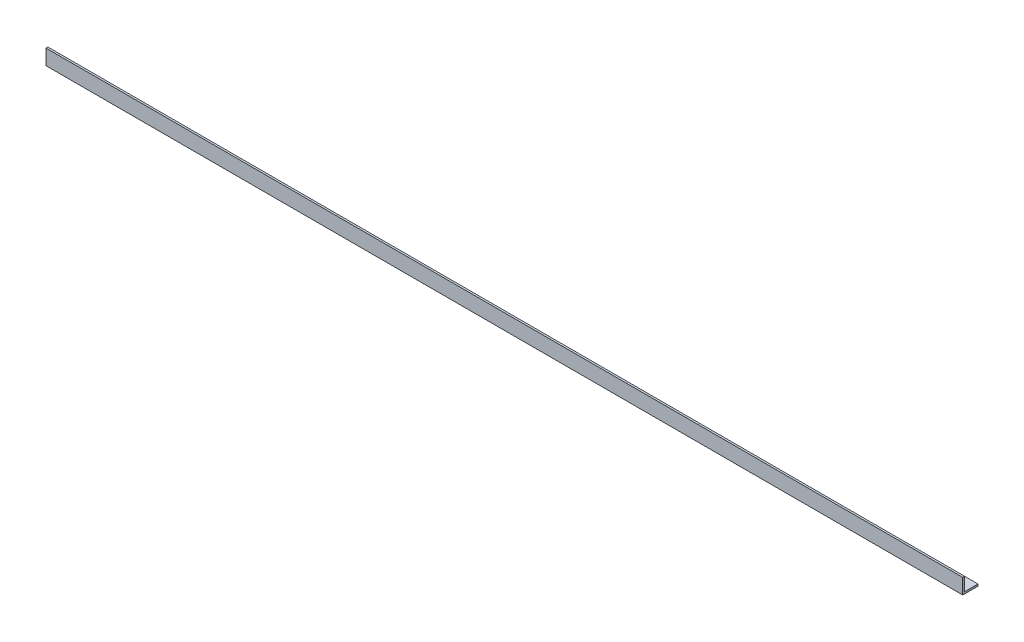
ISO-10303-21;
HEADER;
FILE_DESCRIPTION(('STEP AP214'),'2;1');
FILE_NAME('part.step','',(''),(''),'','','');
FILE_SCHEMA(('AUTOMOTIVE_DESIGN { 1 0 10303 214 1 1 1 1 }'));
ENDSEC;
DATA;
#1=APPLICATION_CONTEXT('core data for automotive mechanical design processes');
#2=APPLICATION_PROTOCOL_DEFINITION('international standard','automotive_design',2000,#1);
#3=PRODUCT_CONTEXT('',#1,'mechanical');
#4=PRODUCT('Part','Part','',(#3));
#5=PRODUCT_RELATED_PRODUCT_CATEGORY('part','',(#4));
#6=PRODUCT_DEFINITION_FORMATION('','',#4);
#7=PRODUCT_DEFINITION_CONTEXT('part definition',#1,'design');
#8=PRODUCT_DEFINITION('design','',#6,#7);
#9=PRODUCT_DEFINITION_SHAPE('','',#8);
#10=(LENGTH_UNIT() NAMED_UNIT(*) SI_UNIT(.MILLI.,.METRE.));
#11=(NAMED_UNIT(*) PLANE_ANGLE_UNIT() SI_UNIT($,.RADIAN.));
#12=(NAMED_UNIT(*) SI_UNIT($,.STERADIAN.) SOLID_ANGLE_UNIT());
#13=UNCERTAINTY_MEASURE_WITH_UNIT(LENGTH_MEASURE(1.E-05),#10,'distance_accuracy_value','');
#14=(GEOMETRIC_REPRESENTATION_CONTEXT(3) GLOBAL_UNCERTAINTY_ASSIGNED_CONTEXT((#13)) GLOBAL_UNIT_ASSIGNED_CONTEXT((#10,
#11,#12)) REPRESENTATION_CONTEXT('',''));
#15=CARTESIAN_POINT('',(0.,0.,0.));
#16=DIRECTION('',(0.,0.,1.));
#17=DIRECTION('',(1.,0.,0.));
#18=AXIS2_PLACEMENT_3D('',#15,#16,#17);
#19=CARTESIAN_POINT('',(762.,0.,-25.4));
#20=DIRECTION('',(0.,1.,0.));
#21=DIRECTION('',(0.,0.,1.));
#22=AXIS2_PLACEMENT_3D('',#19,#20,#21);
#23=PLANE('',#22);
#24=DIRECTION('',(0.,0.,-1.));
#25=VECTOR('',#24,1.);
#26=CARTESIAN_POINT('',(-762.,0.,-25.3999999999988));
#27=LINE('',#26,#25);
#28=CARTESIAN_POINT('',(-762.,0.,1.16573417585641E-12));
#29=VERTEX_POINT('',#28);
#30=CARTESIAN_POINT('',(-762.,0.,-25.3999999999988));
#31=VERTEX_POINT('',#30);
#32=EDGE_CURVE('E144',#29,#31,#27,.T.);
#33=ORIENTED_EDGE('',*,*,#32,.T.);
#34=DIRECTION('',(-1.,0.,0.));
#35=VECTOR('',#34,1.);
#36=CARTESIAN_POINT('',(762.,0.,-25.4));
#37=LINE('',#36,#35);
#38=CARTESIAN_POINT('',(762.,0.,-25.4));
#39=VERTEX_POINT('',#38);
#40=EDGE_CURVE('E11',#39,#31,#37,.T.);
#41=ORIENTED_EDGE('',*,*,#40,.F.);
#42=DIRECTION('',(0.,0.,-1.));
#43=VECTOR('',#42,1.);
#44=CARTESIAN_POINT('',(762.,0.,-25.4));
#45=LINE('',#44,#43);
#46=CARTESIAN_POINT('',(762.,0.,0.));
#47=VERTEX_POINT('',#46);
#48=EDGE_CURVE('E160',#47,#39,#45,.T.);
#49=ORIENTED_EDGE('',*,*,#48,.F.);
#50=DIRECTION('',(-1.,0.,0.));
#51=VECTOR('',#50,1.);
#52=CARTESIAN_POINT('',(762.,0.,0.));
#53=LINE('',#52,#51);
#54=EDGE_CURVE('E140',#47,#29,#53,.T.);
#55=ORIENTED_EDGE('',*,*,#54,.T.);
#56=EDGE_LOOP('',(#33,#41,#49,#55));
#57=FACE_BOUND('',#56,.T.);
#58=ADVANCED_FACE('F42',(#57),#23,.F.);
#59=CARTESIAN_POINT('',(762.,3.17499999999993,-25.4));
#60=DIRECTION('',(0.,0.,1.));
#61=DIRECTION('',(1.,0.,0.));
#62=AXIS2_PLACEMENT_3D('',#59,#60,#61);
#63=PLANE('',#62);
#64=DIRECTION('',(0.,1.,0.));
#65=VECTOR('',#64,1.);
#66=CARTESIAN_POINT('',(-762.,3.17499999999993,-25.3999999999988));
#67=LINE('',#66,#65);
#68=CARTESIAN_POINT('',(-762.,3.17499999999993,-25.3999999999988));
#69=VERTEX_POINT('',#68);
#70=EDGE_CURVE('E148',#31,#69,#67,.T.);
#71=ORIENTED_EDGE('',*,*,#70,.T.);
#72=DIRECTION('',(-1.,0.,0.));
#73=VECTOR('',#72,1.);
#74=CARTESIAN_POINT('',(762.,3.17499999999993,-25.4));
#75=LINE('',#74,#73);
#76=CARTESIAN_POINT('',(762.,3.17499999999993,-25.4));
#77=VERTEX_POINT('',#76);
#78=EDGE_CURVE('E51',#77,#69,#75,.T.);
#79=ORIENTED_EDGE('',*,*,#78,.F.);
#80=DIRECTION('',(0.,1.,0.));
#81=VECTOR('',#80,1.);
#82=CARTESIAN_POINT('',(762.,3.17499999999993,-25.4));
#83=LINE('',#82,#81);
#84=EDGE_CURVE('E108',#39,#77,#83,.T.);
#85=ORIENTED_EDGE('',*,*,#84,.F.);
#86=ORIENTED_EDGE('',*,*,#40,.T.);
#87=EDGE_LOOP('',(#71,#79,#85,#86));
#88=FACE_BOUND('',#87,.T.);
#89=ADVANCED_FACE('F191',(#88),#63,.F.);
#90=CARTESIAN_POINT('',(762.,3.17499999999993,-3.17499999999998));
#91=DIRECTION('',(0.,-1.,0.));
#92=DIRECTION('',(0.,0.,-1.));
#93=AXIS2_PLACEMENT_3D('',#90,#91,#92);
#94=PLANE('',#93);
#95=DIRECTION('',(0.,0.,1.));
#96=VECTOR('',#95,1.);
#97=CARTESIAN_POINT('',(-762.,3.17499999999993,-3.17499999999882));
#98=LINE('',#97,#96);
#99=CARTESIAN_POINT('',(-762.,3.17499999999993,-3.17499999999882));
#100=VERTEX_POINT('',#99);
#101=EDGE_CURVE('E151',#69,#100,#98,.T.);
#102=ORIENTED_EDGE('',*,*,#101,.T.);
#103=DIRECTION('',(-1.,0.,0.));
#104=VECTOR('',#103,1.);
#105=CARTESIAN_POINT('',(762.,3.17499999999993,-3.17499999999998));
#106=LINE('',#105,#104);
#107=CARTESIAN_POINT('',(762.,3.17499999999993,-3.17499999999998));
#108=VERTEX_POINT('',#107);
#109=EDGE_CURVE('E132',#108,#100,#106,.T.);
#110=ORIENTED_EDGE('',*,*,#109,.F.);
#111=DIRECTION('',(0.,0.,1.));
#112=VECTOR('',#111,1.);
#113=CARTESIAN_POINT('',(762.,3.17499999999993,-3.17499999999998));
#114=LINE('',#113,#112);
#115=EDGE_CURVE('E121',#77,#108,#114,.T.);
#116=ORIENTED_EDGE('',*,*,#115,.F.);
#117=ORIENTED_EDGE('',*,*,#78,.T.);
#118=EDGE_LOOP('',(#102,#110,#116,#117));
#119=FACE_BOUND('',#118,.T.);
#120=ADVANCED_FACE('F173',(#119),#94,.F.);
#121=CARTESIAN_POINT('',(762.,25.4000000000001,-3.17499999999998));
#122=DIRECTION('',(0.,0.,1.));
#123=DIRECTION('',(0.,-1.,0.));
#124=AXIS2_PLACEMENT_3D('',#121,#122,#123);
#125=PLANE('',#124);
#126=DIRECTION('',(0.,1.,0.));
#127=VECTOR('',#126,1.);
#128=CARTESIAN_POINT('',(-762.,25.4000000000001,-3.17499999999882));
#129=LINE('',#128,#127);
#130=CARTESIAN_POINT('',(-762.,25.4000000000001,-3.17499999999882));
#131=VERTEX_POINT('',#130);
#132=EDGE_CURVE('E130',#100,#131,#129,.T.);
#133=ORIENTED_EDGE('',*,*,#132,.T.);
#134=DIRECTION('',(-1.,0.,0.));
#135=VECTOR('',#134,1.);
#136=CARTESIAN_POINT('',(762.,25.4000000000001,-3.17499999999998));
#137=LINE('',#136,#135);
#138=CARTESIAN_POINT('',(762.,25.4000000000001,-3.17499999999998));
#139=VERTEX_POINT('',#138);
#140=EDGE_CURVE('E127',#139,#131,#137,.T.);
#141=ORIENTED_EDGE('',*,*,#140,.F.);
#142=DIRECTION('',(0.,1.,0.));
#143=VECTOR('',#142,1.);
#144=CARTESIAN_POINT('',(762.,25.4000000000001,-3.17499999999998));
#145=LINE('',#144,#143);
#146=EDGE_CURVE('E115',#108,#139,#145,.T.);
#147=ORIENTED_EDGE('',*,*,#146,.F.);
#148=ORIENTED_EDGE('',*,*,#109,.T.);
#149=EDGE_LOOP('',(#133,#141,#147,#148));
#150=FACE_BOUND('',#149,.T.);
#151=ADVANCED_FACE('F128',(#150),#125,.F.);
#152=CARTESIAN_POINT('',(762.,25.4000000000001,0.));
#153=DIRECTION('',(0.,-1.,0.));
#154=DIRECTION('',(0.,0.,-1.));
#155=AXIS2_PLACEMENT_3D('',#152,#153,#154);
#156=PLANE('',#155);
#157=DIRECTION('',(0.,0.,1.));
#158=VECTOR('',#157,1.);
#159=CARTESIAN_POINT('',(-762.,25.4000000000001,1.16573417585641E-12));
#160=LINE('',#159,#158);
#161=CARTESIAN_POINT('',(-762.,25.4000000000001,1.16573417585641E-12));
#162=VERTEX_POINT('',#161);
#163=EDGE_CURVE('E92',#131,#162,#160,.T.);
#164=ORIENTED_EDGE('',*,*,#163,.T.);
#165=DIRECTION('',(-1.,0.,0.));
#166=VECTOR('',#165,1.);
#167=CARTESIAN_POINT('',(762.,25.4000000000001,0.));
#168=LINE('',#167,#166);
#169=CARTESIAN_POINT('',(762.,25.4000000000001,0.));
#170=VERTEX_POINT('',#169);
#171=EDGE_CURVE('E133',#170,#162,#168,.T.);
#172=ORIENTED_EDGE('',*,*,#171,.F.);
#173=DIRECTION('',(0.,0.,1.));
#174=VECTOR('',#173,1.);
#175=CARTESIAN_POINT('',(762.,25.4000000000001,0.));
#176=LINE('',#175,#174);
#177=EDGE_CURVE('E119',#139,#170,#176,.T.);
#178=ORIENTED_EDGE('',*,*,#177,.F.);
#179=ORIENTED_EDGE('',*,*,#140,.T.);
#180=EDGE_LOOP('',(#164,#172,#178,#179));
#181=FACE_BOUND('',#180,.T.);
#182=ADVANCED_FACE('F135',(#181),#156,.F.);
#183=CARTESIAN_POINT('',(762.,0.,0.));
#184=DIRECTION('',(0.,0.,-1.));
#185=DIRECTION('',(-1.,0.,0.));
#186=AXIS2_PLACEMENT_3D('',#183,#184,#185);
#187=PLANE('',#186);
#188=DIRECTION('',(0.,-1.,0.));
#189=VECTOR('',#188,1.);
#190=CARTESIAN_POINT('',(-762.,0.,1.16573417585641E-12));
#191=LINE('',#190,#189);
#192=EDGE_CURVE('E99',#162,#29,#191,.T.);
#193=ORIENTED_EDGE('',*,*,#192,.T.);
#194=ORIENTED_EDGE('',*,*,#54,.F.);
#195=DIRECTION('',(0.,-1.,0.));
#196=VECTOR('',#195,1.);
#197=CARTESIAN_POINT('',(762.,0.,0.));
#198=LINE('',#197,#196);
#199=EDGE_CURVE('E62',#170,#47,#198,.T.);
#200=ORIENTED_EDGE('',*,*,#199,.F.);
#201=ORIENTED_EDGE('',*,*,#171,.T.);
#202=EDGE_LOOP('',(#193,#194,#200,#201));
#203=FACE_BOUND('',#202,.T.);
#204=ADVANCED_FACE('F180',(#203),#187,.F.);
#205=CARTESIAN_POINT('',(762.,0.,0.));
#206=DIRECTION('',(-1.,0.,0.));
#207=DIRECTION('',(0.,0.,1.));
#208=AXIS2_PLACEMENT_3D('',#205,#206,#207);
#209=PLANE('',#208);
#210=ORIENTED_EDGE('',*,*,#48,.T.);
#211=ORIENTED_EDGE('',*,*,#84,.T.);
#212=ORIENTED_EDGE('',*,*,#115,.T.);
#213=ORIENTED_EDGE('',*,*,#146,.T.);
#214=ORIENTED_EDGE('',*,*,#177,.T.);
#215=ORIENTED_EDGE('',*,*,#199,.T.);
#216=EDGE_LOOP('',(#210,#211,#212,#213,#214,#215));
#217=FACE_BOUND('',#216,.T.);
#218=ADVANCED_FACE('F117',(#217),#209,.F.);
#219=CARTESIAN_POINT('',(-762.,0.,1.16573417585641E-12));
#220=DIRECTION('',(-1.,0.,0.));
#221=DIRECTION('',(0.,0.,1.));
#222=AXIS2_PLACEMENT_3D('',#219,#220,#221);
#223=PLANE('',#222);
#224=ORIENTED_EDGE('',*,*,#32,.F.);
#225=ORIENTED_EDGE('',*,*,#192,.F.);
#226=ORIENTED_EDGE('',*,*,#163,.F.);
#227=ORIENTED_EDGE('',*,*,#132,.F.);
#228=ORIENTED_EDGE('',*,*,#101,.F.);
#229=ORIENTED_EDGE('',*,*,#70,.F.);
#230=EDGE_LOOP('',(#224,#225,#226,#227,#228,#229));
#231=FACE_BOUND('',#230,.T.);
#232=ADVANCED_FACE('F176',(#231),#223,.T.);
#233=CLOSED_SHELL('',(#58,#89,#120,#151,#182,#204,#218,#232));
#234=MANIFOLD_SOLID_BREP('B2',#233);
#235=ADVANCED_BREP_SHAPE_REPRESENTATION('',(#18,#234),#14);
#236=SHAPE_DEFINITION_REPRESENTATION(#9,#235);
ENDSEC;
END-ISO-10303-21;
